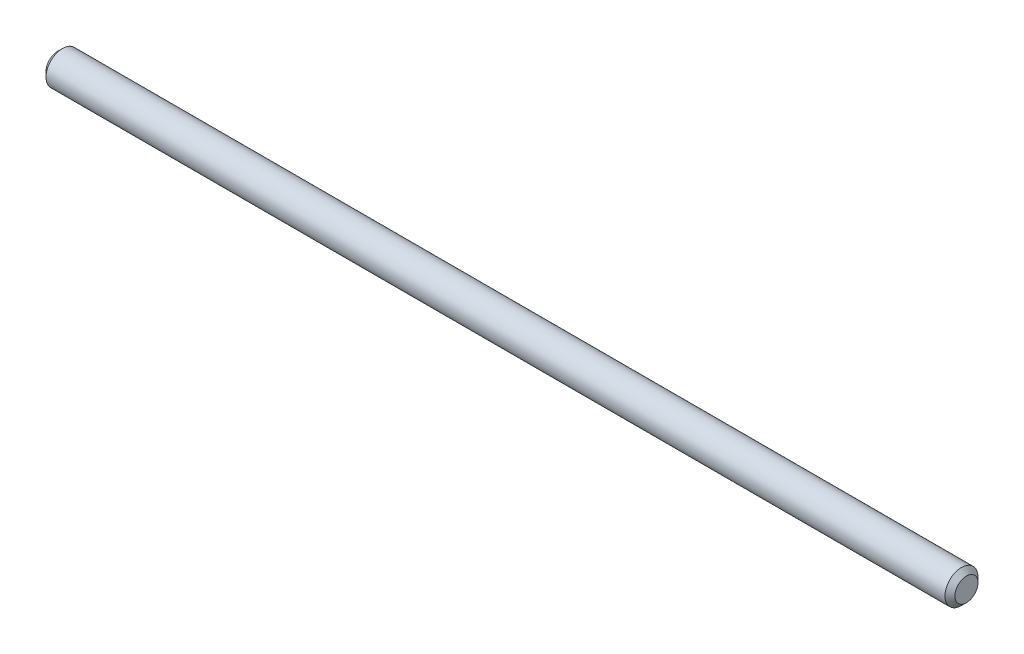
ISO-10303-21;
HEADER;
FILE_DESCRIPTION(('STEP AP214'),'2;1');
FILE_NAME('part.step','',(''),(''),'','','');
FILE_SCHEMA(('AUTOMOTIVE_DESIGN { 1 0 10303 214 1 1 1 1 }'));
ENDSEC;
DATA;
#1=APPLICATION_CONTEXT('core data for automotive mechanical design processes');
#2=APPLICATION_PROTOCOL_DEFINITION('international standard','automotive_design',2000,#1);
#3=PRODUCT_CONTEXT('',#1,'mechanical');
#4=PRODUCT('Part','Part','',(#3));
#5=PRODUCT_RELATED_PRODUCT_CATEGORY('part','',(#4));
#6=PRODUCT_DEFINITION_FORMATION('','',#4);
#7=PRODUCT_DEFINITION_CONTEXT('part definition',#1,'design');
#8=PRODUCT_DEFINITION('design','',#6,#7);
#9=PRODUCT_DEFINITION_SHAPE('','',#8);
#10=(LENGTH_UNIT() NAMED_UNIT(*) SI_UNIT(.MILLI.,.METRE.));
#11=(NAMED_UNIT(*) PLANE_ANGLE_UNIT() SI_UNIT($,.RADIAN.));
#12=(NAMED_UNIT(*) SI_UNIT($,.STERADIAN.) SOLID_ANGLE_UNIT());
#13=UNCERTAINTY_MEASURE_WITH_UNIT(LENGTH_MEASURE(1.E-05),#10,'distance_accuracy_value','');
#14=(GEOMETRIC_REPRESENTATION_CONTEXT(3) GLOBAL_UNCERTAINTY_ASSIGNED_CONTEXT((#13)) GLOBAL_UNIT_ASSIGNED_CONTEXT((#10,
#11,#12)) REPRESENTATION_CONTEXT('',''));
#15=CARTESIAN_POINT('',(0.,0.,0.));
#16=DIRECTION('',(0.,0.,1.));
#17=DIRECTION('',(1.,0.,0.));
#18=AXIS2_PLACEMENT_3D('',#15,#16,#17);
#19=CARTESIAN_POINT('',(-87.3125,0.,0.));
#20=DIRECTION('',(1.,0.,0.));
#21=DIRECTION('',(0.,0.,-1.));
#22=AXIS2_PLACEMENT_3D('',#19,#20,#21);
#23=CYLINDRICAL_SURFACE('',#22,3.175);
#24=CARTESIAN_POINT('',(-86.36,0.,0.));
#25=DIRECTION('',(1.,0.,0.));
#26=DIRECTION('',(0.,0.,-1.));
#27=AXIS2_PLACEMENT_3D('',#24,#25,#26);
#28=CIRCLE('',#27,3.175);
#29=CARTESIAN_POINT('',(-86.36,0.,-3.17499999999997));
#30=VERTEX_POINT('',#29);
#31=EDGE_CURVE('E43',#30,#30,#28,.T.);
#32=ORIENTED_EDGE('',*,*,#31,.T.);
#33=EDGE_LOOP('',(#32));
#34=FACE_BOUND('',#33,.T.);
#35=CARTESIAN_POINT('',(86.3600000000001,0.,1.11022302462516E-13));
#36=DIRECTION('',(1.,0.,0.));
#37=DIRECTION('',(0.,0.,-1.));
#38=AXIS2_PLACEMENT_3D('',#35,#36,#37);
#39=CIRCLE('',#38,3.175);
#40=CARTESIAN_POINT('',(86.3600000000001,0.,-3.17499999999989));
#41=VERTEX_POINT('',#40);
#42=EDGE_CURVE('E47',#41,#41,#39,.F.);
#43=ORIENTED_EDGE('',*,*,#42,.T.);
#44=EDGE_LOOP('',(#43));
#45=FACE_BOUND('',#44,.T.);
#46=ADVANCED_FACE('F32',(#34,#45),#23,.T.);
#47=CARTESIAN_POINT('',(-87.3125,0.,0.));
#48=DIRECTION('',(1.,0.,0.));
#49=DIRECTION('',(0.,0.,-1.));
#50=AXIS2_PLACEMENT_3D('',#47,#48,#49);
#51=PLANE('',#50);
#52=CARTESIAN_POINT('',(-87.3125,0.,0.));
#53=DIRECTION('',(1.,0.,0.));
#54=DIRECTION('',(0.,0.,-1.));
#55=AXIS2_PLACEMENT_3D('',#52,#53,#54);
#56=CIRCLE('',#55,2.2225);
#57=CARTESIAN_POINT('',(-87.3125,0.,-2.22250000000003));
#58=VERTEX_POINT('',#57);
#59=EDGE_CURVE('E39',#58,#58,#56,.F.);
#60=ORIENTED_EDGE('',*,*,#59,.T.);
#61=EDGE_LOOP('',(#60));
#62=FACE_BOUND('',#61,.T.);
#63=ADVANCED_FACE('F63',(#62),#51,.F.);
#64=CARTESIAN_POINT('',(87.3125000000001,0.,1.94289029309402E-13));
#65=DIRECTION('',(1.,0.,0.));
#66=DIRECTION('',(0.,0.,-1.));
#67=AXIS2_PLACEMENT_3D('',#64,#65,#66);
#68=PLANE('',#67);
#69=CARTESIAN_POINT('',(87.3125000000001,0.,1.94289029309402E-13));
#70=DIRECTION('',(1.,0.,0.));
#71=DIRECTION('',(0.,0.,-1.));
#72=AXIS2_PLACEMENT_3D('',#69,#70,#71);
#73=CIRCLE('',#72,2.22250000000002);
#74=CARTESIAN_POINT('',(87.3125000000001,0.,-2.22249999999982));
#75=VERTEX_POINT('',#74);
#76=EDGE_CURVE('E10',#75,#75,#73,.T.);
#77=ORIENTED_EDGE('',*,*,#76,.T.);
#78=EDGE_LOOP('',(#77));
#79=FACE_BOUND('',#78,.T.);
#80=ADVANCED_FACE('F60',(#79),#68,.T.);
#81=CARTESIAN_POINT('',(-86.36,0.,0.));
#82=DIRECTION('',(1.,0.,0.));
#83=DIRECTION('',(0.,0.,-1.));
#84=AXIS2_PLACEMENT_3D('',#81,#82,#83);
#85=CONICAL_SURFACE('',#84,3.175,0.785398163397436);
#86=ORIENTED_EDGE('',*,*,#59,.F.);
#87=EDGE_LOOP('',(#86));
#88=FACE_BOUND('',#87,.T.);
#89=ORIENTED_EDGE('',*,*,#31,.F.);
#90=EDGE_LOOP('',(#89));
#91=FACE_BOUND('',#90,.T.);
#92=ADVANCED_FACE('F56',(#88,#91),#85,.T.);
#93=CARTESIAN_POINT('',(87.3125000000001,0.,1.94289029309402E-13));
#94=DIRECTION('',(-1.,0.,0.));
#95=DIRECTION('',(0.,0.,1.));
#96=AXIS2_PLACEMENT_3D('',#93,#94,#95);
#97=CONICAL_SURFACE('',#96,2.22250000000002,0.785398163397458);
#98=ORIENTED_EDGE('',*,*,#42,.F.);
#99=EDGE_LOOP('',(#98));
#100=FACE_BOUND('',#99,.T.);
#101=ORIENTED_EDGE('',*,*,#76,.F.);
#102=EDGE_LOOP('',(#101));
#103=FACE_BOUND('',#102,.T.);
#104=ADVANCED_FACE('F34',(#100,#103),#97,.T.);
#105=CLOSED_SHELL('',(#46,#63,#80,#92,#104));
#106=MANIFOLD_SOLID_BREP('B2',#105);
#107=ADVANCED_BREP_SHAPE_REPRESENTATION('',(#18,#106),#14);
#108=SHAPE_DEFINITION_REPRESENTATION(#9,#107);
ENDSEC;
END-ISO-10303-21;
